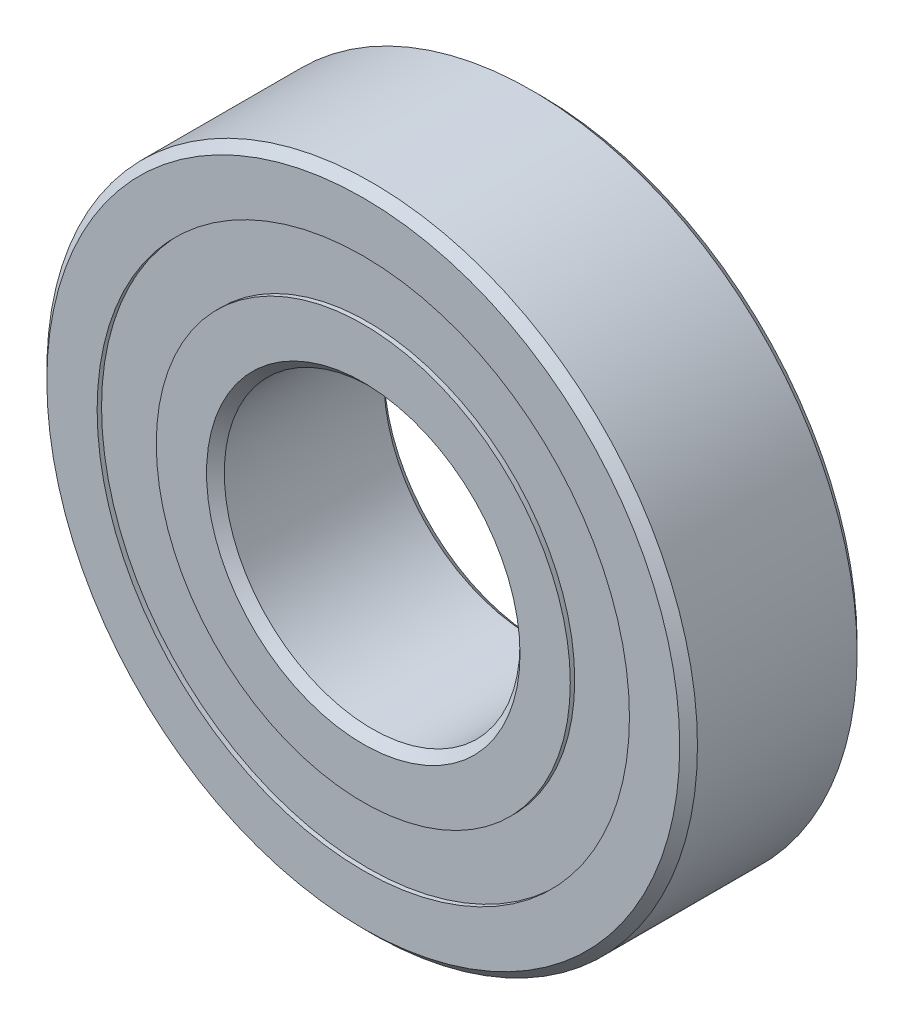
ISO-10303-21;
HEADER;
FILE_DESCRIPTION(('STEP AP214'),'2;1');
FILE_NAME('part.step','',(''),(''),'','','');
FILE_SCHEMA(('AUTOMOTIVE_DESIGN { 1 0 10303 214 1 1 1 1 }'));
ENDSEC;
DATA;
#1=APPLICATION_CONTEXT('core data for automotive mechanical design processes');
#2=APPLICATION_PROTOCOL_DEFINITION('international standard','automotive_design',2000,#1);
#3=PRODUCT_CONTEXT('',#1,'mechanical');
#4=PRODUCT('Part','Part','',(#3));
#5=PRODUCT_RELATED_PRODUCT_CATEGORY('part','',(#4));
#6=PRODUCT_DEFINITION_FORMATION('','',#4);
#7=PRODUCT_DEFINITION_CONTEXT('part definition',#1,'design');
#8=PRODUCT_DEFINITION('design','',#6,#7);
#9=PRODUCT_DEFINITION_SHAPE('','',#8);
#10=(LENGTH_UNIT() NAMED_UNIT(*) SI_UNIT(.MILLI.,.METRE.));
#11=(NAMED_UNIT(*) PLANE_ANGLE_UNIT() SI_UNIT($,.RADIAN.));
#12=(NAMED_UNIT(*) SI_UNIT($,.STERADIAN.) SOLID_ANGLE_UNIT());
#13=UNCERTAINTY_MEASURE_WITH_UNIT(LENGTH_MEASURE(1.E-05),#10,'distance_accuracy_value','');
#14=(GEOMETRIC_REPRESENTATION_CONTEXT(3) GLOBAL_UNCERTAINTY_ASSIGNED_CONTEXT((#13)) GLOBAL_UNIT_ASSIGNED_CONTEXT((#10,
#11,#12)) REPRESENTATION_CONTEXT('',''));
#15=CARTESIAN_POINT('',(0.,0.,0.));
#16=DIRECTION('',(0.,0.,1.));
#17=DIRECTION('',(1.,0.,0.));
#18=AXIS2_PLACEMENT_3D('',#15,#16,#17);
#19=CARTESIAN_POINT('',(0.,9.,-2.85));
#20=DIRECTION('',(0.,0.,1.));
#21=DIRECTION('',(1.,0.,0.));
#22=AXIS2_PLACEMENT_3D('',#19,#20,#21);
#23=PLANE('',#22);
#24=CARTESIAN_POINT('',(0.,0.,-2.85));
#25=DIRECTION('',(0.,0.,1.));
#26=DIRECTION('',(1.,0.,0.));
#27=AXIS2_PLACEMENT_3D('',#24,#25,#26);
#28=CIRCLE('',#27,9.);
#29=CARTESIAN_POINT('',(9.,0.,-2.85));
#30=VERTEX_POINT('',#29);
#31=EDGE_CURVE('E57',#30,#30,#28,.T.);
#32=ORIENTED_EDGE('',*,*,#31,.F.);
#33=EDGE_LOOP('',(#32));
#34=FACE_BOUND('',#33,.T.);
#35=CARTESIAN_POINT('',(0.,0.,-2.85));
#36=DIRECTION('',(0.,0.,1.));
#37=DIRECTION('',(1.,0.,0.));
#38=AXIS2_PLACEMENT_3D('',#35,#36,#37);
#39=CIRCLE('',#38,7.);
#40=CARTESIAN_POINT('',(7.,0.,-2.85));
#41=VERTEX_POINT('',#40);
#42=EDGE_CURVE('E11',#41,#41,#39,.T.);
#43=ORIENTED_EDGE('',*,*,#42,.T.);
#44=EDGE_LOOP('',(#43));
#45=FACE_BOUND('',#44,.T.);
#46=ADVANCED_FACE('F43',(#34,#45),#23,.F.);
#47=CARTESIAN_POINT('',(0.,0.,3.));
#48=DIRECTION('',(0.,0.,1.));
#49=DIRECTION('',(1.,0.,0.));
#50=AXIS2_PLACEMENT_3D('',#47,#48,#49);
#51=CYLINDRICAL_SURFACE('',#50,7.);
#52=ORIENTED_EDGE('',*,*,#42,.F.);
#53=EDGE_LOOP('',(#52));
#54=FACE_BOUND('',#53,.T.);
#55=CARTESIAN_POINT('',(0.,0.,-1.66666666666667));
#56=DIRECTION('',(0.,0.,1.));
#57=DIRECTION('',(1.,0.,0.));
#58=AXIS2_PLACEMENT_3D('',#55,#56,#57);
#59=CIRCLE('',#58,7.);
#60=CARTESIAN_POINT('',(7.,0.,-1.66666666666667));
#61=VERTEX_POINT('',#60);
#62=EDGE_CURVE('E49',#61,#61,#59,.T.);
#63=ORIENTED_EDGE('',*,*,#62,.T.);
#64=EDGE_LOOP('',(#63));
#65=FACE_BOUND('',#64,.T.);
#66=ADVANCED_FACE('F66',(#54,#65),#51,.F.);
#67=CARTESIAN_POINT('',(0.,9.,-1.66666666666667));
#68=DIRECTION('',(0.,0.,-1.));
#69=DIRECTION('',(-1.,0.,0.));
#70=AXIS2_PLACEMENT_3D('',#67,#68,#69);
#71=PLANE('',#70);
#72=ORIENTED_EDGE('',*,*,#62,.F.);
#73=EDGE_LOOP('',(#72));
#74=FACE_BOUND('',#73,.T.);
#75=CARTESIAN_POINT('',(0.,0.,-1.66666666666667));
#76=DIRECTION('',(0.,0.,1.));
#77=DIRECTION('',(1.,0.,0.));
#78=AXIS2_PLACEMENT_3D('',#75,#76,#77);
#79=CIRCLE('',#78,9.);
#80=CARTESIAN_POINT('',(9.,0.,-1.66666666666667));
#81=VERTEX_POINT('',#80);
#82=EDGE_CURVE('E53',#81,#81,#79,.T.);
#83=ORIENTED_EDGE('',*,*,#82,.T.);
#84=EDGE_LOOP('',(#83));
#85=FACE_BOUND('',#84,.T.);
#86=ADVANCED_FACE('F70',(#74,#85),#71,.F.);
#87=CARTESIAN_POINT('',(0.,0.,3.));
#88=DIRECTION('',(0.,0.,1.));
#89=DIRECTION('',(1.,0.,0.));
#90=AXIS2_PLACEMENT_3D('',#87,#88,#89);
#91=CYLINDRICAL_SURFACE('',#90,9.);
#92=ORIENTED_EDGE('',*,*,#82,.F.);
#93=EDGE_LOOP('',(#92));
#94=FACE_BOUND('',#93,.T.);
#95=ORIENTED_EDGE('',*,*,#31,.T.);
#96=EDGE_LOOP('',(#95));
#97=FACE_BOUND('',#96,.T.);
#98=ADVANCED_FACE('F63',(#94,#97),#91,.T.);
#99=CLOSED_SHELL('',(#46,#66,#86,#98));
#100=MANIFOLD_SOLID_BREP('B2',#99);
#101=CARTESIAN_POINT('',(0.,9.,2.85));
#102=DIRECTION('',(0.,0.,-1.));
#103=DIRECTION('',(-1.,0.,0.));
#104=AXIS2_PLACEMENT_3D('',#101,#102,#103);
#105=PLANE('',#104);
#106=CARTESIAN_POINT('',(0.,0.,2.85));
#107=DIRECTION('',(0.,0.,1.));
#108=DIRECTION('',(1.,0.,0.));
#109=AXIS2_PLACEMENT_3D('',#106,#107,#108);
#110=CIRCLE('',#109,7.);
#111=CARTESIAN_POINT('',(7.,0.,2.85));
#112=VERTEX_POINT('',#111);
#113=EDGE_CURVE('E42',#112,#112,#110,.T.);
#114=ORIENTED_EDGE('',*,*,#113,.F.);
#115=EDGE_LOOP('',(#114));
#116=FACE_BOUND('',#115,.T.);
#117=CARTESIAN_POINT('',(0.,0.,2.85));
#118=DIRECTION('',(0.,0.,1.));
#119=DIRECTION('',(1.,0.,0.));
#120=AXIS2_PLACEMENT_3D('',#117,#118,#119);
#121=CIRCLE('',#120,9.);
#122=CARTESIAN_POINT('',(9.,0.,2.85));
#123=VERTEX_POINT('',#122);
#124=EDGE_CURVE('E124',#123,#123,#121,.T.);
#125=ORIENTED_EDGE('',*,*,#124,.T.);
#126=EDGE_LOOP('',(#125));
#127=FACE_BOUND('',#126,.T.);
#128=ADVANCED_FACE('F110',(#116,#127),#105,.F.);
#129=CARTESIAN_POINT('',(0.,0.,3.));
#130=DIRECTION('',(0.,0.,1.));
#131=DIRECTION('',(1.,0.,0.));
#132=AXIS2_PLACEMENT_3D('',#129,#130,#131);
#133=CYLINDRICAL_SURFACE('',#132,7.);
#134=CARTESIAN_POINT('',(0.,0.,1.66666666666667));
#135=DIRECTION('',(0.,0.,1.));
#136=DIRECTION('',(1.,0.,0.));
#137=AXIS2_PLACEMENT_3D('',#134,#135,#136);
#138=CIRCLE('',#137,7.);
#139=CARTESIAN_POINT('',(7.,0.,1.66666666666667));
#140=VERTEX_POINT('',#139);
#141=EDGE_CURVE('E116',#140,#140,#138,.T.);
#142=ORIENTED_EDGE('',*,*,#141,.F.);
#143=EDGE_LOOP('',(#142));
#144=FACE_BOUND('',#143,.T.);
#145=ORIENTED_EDGE('',*,*,#113,.T.);
#146=EDGE_LOOP('',(#145));
#147=FACE_BOUND('',#146,.T.);
#148=ADVANCED_FACE('F139',(#144,#147),#133,.F.);
#149=CARTESIAN_POINT('',(0.,9.,1.66666666666667));
#150=DIRECTION('',(0.,0.,1.));
#151=DIRECTION('',(1.,0.,0.));
#152=AXIS2_PLACEMENT_3D('',#149,#150,#151);
#153=PLANE('',#152);
#154=CARTESIAN_POINT('',(0.,0.,1.66666666666667));
#155=DIRECTION('',(0.,0.,1.));
#156=DIRECTION('',(1.,0.,0.));
#157=AXIS2_PLACEMENT_3D('',#154,#155,#156);
#158=CIRCLE('',#157,9.);
#159=CARTESIAN_POINT('',(9.,0.,1.66666666666667));
#160=VERTEX_POINT('',#159);
#161=EDGE_CURVE('E120',#160,#160,#158,.T.);
#162=ORIENTED_EDGE('',*,*,#161,.F.);
#163=EDGE_LOOP('',(#162));
#164=FACE_BOUND('',#163,.T.);
#165=ORIENTED_EDGE('',*,*,#141,.T.);
#166=EDGE_LOOP('',(#165));
#167=FACE_BOUND('',#166,.T.);
#168=ADVANCED_FACE('F134',(#164,#167),#153,.F.);
#169=CARTESIAN_POINT('',(0.,0.,3.));
#170=DIRECTION('',(0.,0.,1.));
#171=DIRECTION('',(1.,0.,0.));
#172=AXIS2_PLACEMENT_3D('',#169,#170,#171);
#173=CYLINDRICAL_SURFACE('',#172,9.);
#174=ORIENTED_EDGE('',*,*,#124,.F.);
#175=EDGE_LOOP('',(#174));
#176=FACE_BOUND('',#175,.T.);
#177=ORIENTED_EDGE('',*,*,#161,.T.);
#178=EDGE_LOOP('',(#177));
#179=FACE_BOUND('',#178,.T.);
#180=ADVANCED_FACE('F131',(#176,#179),#173,.T.);
#181=CLOSED_SHELL('',(#128,#148,#168,#180));
#182=MANIFOLD_SOLID_BREP('B6',#181);
#183=CARTESIAN_POINT('',(-4.7022820183397,6.47213595499964,0.));
#184=DIRECTION('',(0.,0.,1.));
#185=DIRECTION('',(-0.587785252292462,0.809016994374955,0.));
#186=AXIS2_PLACEMENT_3D('',#183,#184,#185);
#187=SPHERICAL_SURFACE('',#186,1.66666666666667);
#188=CARTESIAN_POINT('',(-4.7022820183397,6.47213595499964,1.66666666666667));
#189=VERTEX_POINT('',#188);
#190=VERTEX_LOOP('',#189);
#191=FACE_BOUND('',#190,.T.);
#192=ADVANCED_FACE('F177',(#191),#187,.T.);
#193=CLOSED_SHELL('',(#192));
#194=MANIFOLD_SOLID_BREP('B37',#193);
#195=CARTESIAN_POINT('',(-7.6084521303612,2.47213595499967,0.));
#196=DIRECTION('',(0.,0.,1.));
#197=DIRECTION('',(-0.95105651629515,0.309016994374958,0.));
#198=AXIS2_PLACEMENT_3D('',#195,#196,#197);
#199=SPHERICAL_SURFACE('',#198,1.66666666666667);
#200=CARTESIAN_POINT('',(-7.6084521303612,2.47213595499967,1.66666666666667));
#201=VERTEX_POINT('',#200);
#202=VERTEX_LOOP('',#201);
#203=FACE_BOUND('',#202,.T.);
#204=ADVANCED_FACE('F197',(#203),#199,.T.);
#205=CLOSED_SHELL('',(#204));
#206=MANIFOLD_SOLID_BREP('B106',#205);
#207=CARTESIAN_POINT('',(-7.60845213036125,-2.47213595499951,0.));
#208=DIRECTION('',(0.,0.,1.));
#209=DIRECTION('',(-0.951056516295157,-0.309016994374938,0.));
#210=AXIS2_PLACEMENT_3D('',#207,#208,#209);
#211=SPHERICAL_SURFACE('',#210,1.66666666666667);
#212=CARTESIAN_POINT('',(-7.60845213036125,-2.47213595499951,1.66666666666667));
#213=VERTEX_POINT('',#212);
#214=VERTEX_LOOP('',#213);
#215=FACE_BOUND('',#214,.T.);
#216=ADVANCED_FACE('F217',(#215),#211,.T.);
#217=CLOSED_SHELL('',(#216));
#218=MANIFOLD_SOLID_BREP('B173',#217);
#219=CARTESIAN_POINT('',(-4.70228201833984,-6.47213595499954,0.));
#220=DIRECTION('',(0.,0.,1.));
#221=DIRECTION('',(-0.58778525229248,-0.809016994374942,0.));
#222=AXIS2_PLACEMENT_3D('',#219,#220,#221);
#223=SPHERICAL_SURFACE('',#222,1.66666666666667);
#224=CARTESIAN_POINT('',(-4.70228201833984,-6.47213595499954,1.66666666666667));
#225=VERTEX_POINT('',#224);
#226=VERTEX_LOOP('',#225);
#227=FACE_BOUND('',#226,.T.);
#228=ADVANCED_FACE('F237',(#227),#223,.T.);
#229=CLOSED_SHELL('',(#228));
#230=MANIFOLD_SOLID_BREP('B193',#229);
#231=CARTESIAN_POINT('',(0.,-8.,0.));
#232=DIRECTION('',(0.,0.,1.));
#233=DIRECTION('',(0.,-1.,0.));
#234=AXIS2_PLACEMENT_3D('',#231,#232,#233);
#235=SPHERICAL_SURFACE('',#234,1.66666666666667);
#236=CARTESIAN_POINT('',(0.,-8.,1.66666666666667));
#237=VERTEX_POINT('',#236);
#238=VERTEX_LOOP('',#237);
#239=FACE_BOUND('',#238,.T.);
#240=ADVANCED_FACE('F257',(#239),#235,.T.);
#241=CLOSED_SHELL('',(#240));
#242=MANIFOLD_SOLID_BREP('B213',#241);
#243=CARTESIAN_POINT('',(4.70228201833975,-6.47213595499961,0.));
#244=DIRECTION('',(0.,0.,1.));
#245=DIRECTION('',(0.587785252292469,-0.809016994374951,0.));
#246=AXIS2_PLACEMENT_3D('',#243,#244,#245);
#247=SPHERICAL_SURFACE('',#246,1.66666666666667);
#248=CARTESIAN_POINT('',(4.70228201833975,-6.47213595499961,1.66666666666667));
#249=VERTEX_POINT('',#248);
#250=VERTEX_LOOP('',#249);
#251=FACE_BOUND('',#250,.T.);
#252=ADVANCED_FACE('F277',(#251),#247,.T.);
#253=CLOSED_SHELL('',(#252));
#254=MANIFOLD_SOLID_BREP('B233',#253);
#255=CARTESIAN_POINT('',(7.60845213036122,-2.47213595499961,0.));
#256=DIRECTION('',(0.,0.,1.));
#257=DIRECTION('',(0.951056516295152,-0.309016994374952,0.));
#258=AXIS2_PLACEMENT_3D('',#255,#256,#257);
#259=SPHERICAL_SURFACE('',#258,1.66666666666667);
#260=CARTESIAN_POINT('',(7.60845213036122,-2.47213595499961,1.66666666666667));
#261=VERTEX_POINT('',#260);
#262=VERTEX_LOOP('',#261);
#263=FACE_BOUND('',#262,.T.);
#264=ADVANCED_FACE('F297',(#263),#259,.T.);
#265=CLOSED_SHELL('',(#264));
#266=MANIFOLD_SOLID_BREP('B253',#265);
#267=CARTESIAN_POINT('',(7.60845213036124,2.47213595499956,0.));
#268=DIRECTION('',(0.,0.,1.));
#269=DIRECTION('',(0.951056516295155,0.309016994374945,0.));
#270=AXIS2_PLACEMENT_3D('',#267,#268,#269);
#271=SPHERICAL_SURFACE('',#270,1.66666666666667);
#272=CARTESIAN_POINT('',(7.60845213036124,2.47213595499956,1.66666666666667));
#273=VERTEX_POINT('',#272);
#274=VERTEX_LOOP('',#273);
#275=FACE_BOUND('',#274,.T.);
#276=ADVANCED_FACE('F317',(#275),#271,.T.);
#277=CLOSED_SHELL('',(#276));
#278=MANIFOLD_SOLID_BREP('B273',#277);
#279=CARTESIAN_POINT('',(4.70228201833979,6.47213595499957,0.));
#280=DIRECTION('',(0.,0.,1.));
#281=DIRECTION('',(0.587785252292474,0.809016994374947,0.));
#282=AXIS2_PLACEMENT_3D('',#279,#280,#281);
#283=SPHERICAL_SURFACE('',#282,1.66666666666667);
#284=CARTESIAN_POINT('',(4.70228201833979,6.47213595499957,1.66666666666667));
#285=VERTEX_POINT('',#284);
#286=VERTEX_LOOP('',#285);
#287=FACE_BOUND('',#286,.T.);
#288=ADVANCED_FACE('F337',(#287),#283,.T.);
#289=CLOSED_SHELL('',(#288));
#290=MANIFOLD_SOLID_BREP('B293',#289);
#291=CARTESIAN_POINT('',(0.,8.,0.));
#292=DIRECTION('',(0.,0.,1.));
#293=DIRECTION('',(0.,1.,0.));
#294=AXIS2_PLACEMENT_3D('',#291,#292,#293);
#295=SPHERICAL_SURFACE('',#294,1.66666666666667);
#296=CARTESIAN_POINT('',(0.,8.,1.66666666666667));
#297=VERTEX_POINT('',#296);
#298=VERTEX_LOOP('',#297);
#299=FACE_BOUND('',#298,.T.);
#300=ADVANCED_FACE('F359',(#299),#295,.T.);
#301=CLOSED_SHELL('',(#300));
#302=MANIFOLD_SOLID_BREP('B313',#301);
#303=CARTESIAN_POINT('',(0.,0.,3.));
#304=DIRECTION('',(0.,0.,1.));
#305=DIRECTION('',(1.,0.,0.));
#306=AXIS2_PLACEMENT_3D('',#303,#304,#305);
#307=CONICAL_SURFACE('',#306,5.3,0.78539816339745);
#308=CARTESIAN_POINT('',(0.,0.,2.7));
#309=DIRECTION('',(0.,0.,1.));
#310=DIRECTION('',(1.,0.,0.));
#311=AXIS2_PLACEMENT_3D('',#308,#309,#310);
#312=CIRCLE('',#311,5.);
#313=CARTESIAN_POINT('',(5.,0.,2.7));
#314=VERTEX_POINT('',#313);
#315=EDGE_CURVE('E358',#314,#314,#312,.T.);
#316=ORIENTED_EDGE('',*,*,#315,.F.);
#317=EDGE_LOOP('',(#316));
#318=FACE_BOUND('',#317,.T.);
#319=CARTESIAN_POINT('',(0.,0.,3.));
#320=DIRECTION('',(0.,0.,1.));
#321=DIRECTION('',(1.,0.,0.));
#322=AXIS2_PLACEMENT_3D('',#319,#320,#321);
#323=CIRCLE('',#322,5.3);
#324=CARTESIAN_POINT('',(5.3,0.,3.));
#325=VERTEX_POINT('',#324);
#326=EDGE_CURVE('E406',#325,#325,#323,.T.);
#327=ORIENTED_EDGE('',*,*,#326,.T.);
#328=EDGE_LOOP('',(#327));
#329=FACE_BOUND('',#328,.T.);
#330=ADVANCED_FACE('F378',(#318,#329),#307,.F.);
#331=CARTESIAN_POINT('',(0.,0.,3.));
#332=DIRECTION('',(0.,0.,1.));
#333=DIRECTION('',(1.,0.,0.));
#334=AXIS2_PLACEMENT_3D('',#331,#332,#333);
#335=CYLINDRICAL_SURFACE('',#334,5.);
#336=CARTESIAN_POINT('',(0.,0.,-2.7));
#337=DIRECTION('',(0.,0.,1.));
#338=DIRECTION('',(1.,0.,0.));
#339=AXIS2_PLACEMENT_3D('',#336,#337,#338);
#340=CIRCLE('',#339,5.);
#341=CARTESIAN_POINT('',(5.,0.,-2.7));
#342=VERTEX_POINT('',#341);
#343=EDGE_CURVE('E384',#342,#342,#340,.T.);
#344=ORIENTED_EDGE('',*,*,#343,.F.);
#345=EDGE_LOOP('',(#344));
#346=FACE_BOUND('',#345,.T.);
#347=ORIENTED_EDGE('',*,*,#315,.T.);
#348=EDGE_LOOP('',(#347));
#349=FACE_BOUND('',#348,.T.);
#350=ADVANCED_FACE('F443',(#346,#349),#335,.F.);
#351=CARTESIAN_POINT('',(0.,0.,-2.7));
#352=DIRECTION('',(0.,0.,-1.));
#353=DIRECTION('',(-1.,0.,0.));
#354=AXIS2_PLACEMENT_3D('',#351,#352,#353);
#355=CONICAL_SURFACE('',#354,5.,0.78539816339745);
#356=CARTESIAN_POINT('',(0.,0.,-3.));
#357=DIRECTION('',(0.,0.,1.));
#358=DIRECTION('',(1.,0.,0.));
#359=AXIS2_PLACEMENT_3D('',#356,#357,#358);
#360=CIRCLE('',#359,5.3);
#361=CARTESIAN_POINT('',(5.3,0.,-3.));
#362=VERTEX_POINT('',#361);
#363=EDGE_CURVE('E388',#362,#362,#360,.T.);
#364=ORIENTED_EDGE('',*,*,#363,.F.);
#365=EDGE_LOOP('',(#364));
#366=FACE_BOUND('',#365,.T.);
#367=ORIENTED_EDGE('',*,*,#343,.T.);
#368=EDGE_LOOP('',(#367));
#369=FACE_BOUND('',#368,.T.);
#370=ADVANCED_FACE('F438',(#366,#369),#355,.F.);
#371=CARTESIAN_POINT('',(0.,5.3,-3.));
#372=DIRECTION('',(0.,0.,1.));
#373=DIRECTION('',(1.,0.,0.));
#374=AXIS2_PLACEMENT_3D('',#371,#372,#373);
#375=PLANE('',#374);
#376=CARTESIAN_POINT('',(0.,0.,-3.));
#377=DIRECTION('',(0.,0.,1.));
#378=DIRECTION('',(1.,0.,0.));
#379=AXIS2_PLACEMENT_3D('',#376,#377,#378);
#380=CIRCLE('',#379,7.);
#381=CARTESIAN_POINT('',(7.,0.,-3.));
#382=VERTEX_POINT('',#381);
#383=EDGE_CURVE('E392',#382,#382,#380,.T.);
#384=ORIENTED_EDGE('',*,*,#383,.F.);
#385=EDGE_LOOP('',(#384));
#386=FACE_BOUND('',#385,.T.);
#387=ORIENTED_EDGE('',*,*,#363,.T.);
#388=EDGE_LOOP('',(#387));
#389=FACE_BOUND('',#388,.T.);
#390=ADVANCED_FACE('F432',(#386,#389),#375,.F.);
#391=CARTESIAN_POINT('',(0.,0.,3.));
#392=DIRECTION('',(0.,0.,1.));
#393=DIRECTION('',(1.,0.,0.));
#394=AXIS2_PLACEMENT_3D('',#391,#392,#393);
#395=CYLINDRICAL_SURFACE('',#394,7.);
#396=CARTESIAN_POINT('',(0.,0.,-1.33333333333333));
#397=DIRECTION('',(0.,0.,1.));
#398=DIRECTION('',(1.,0.,0.));
#399=AXIS2_PLACEMENT_3D('',#396,#397,#398);
#400=CIRCLE('',#399,7.);
#401=CARTESIAN_POINT('',(7.,0.,-1.33333333333333));
#402=VERTEX_POINT('',#401);
#403=EDGE_CURVE('E397',#402,#402,#400,.T.);
#404=ORIENTED_EDGE('',*,*,#403,.F.);
#405=EDGE_LOOP('',(#404));
#406=FACE_BOUND('',#405,.T.);
#407=ORIENTED_EDGE('',*,*,#383,.T.);
#408=EDGE_LOOP('',(#407));
#409=FACE_BOUND('',#408,.T.);
#410=ADVANCED_FACE('F426',(#406,#409),#395,.T.);
#411=CARTESIAN_POINT('',(0.,0.,0.));
#412=DIRECTION('',(0.,0.,1.));
#413=DIRECTION('',(1.,0.,0.));
#414=AXIS2_PLACEMENT_3D('',#411,#412,#413);
#415=TOROIDAL_SURFACE('',#414,8.,1.66666666666667);
#416=CARTESIAN_POINT('',(0.,0.,1.33333333333333));
#417=DIRECTION('',(0.,0.,1.));
#418=DIRECTION('',(1.,0.,0.));
#419=AXIS2_PLACEMENT_3D('',#416,#417,#418);
#420=CIRCLE('',#419,7.);
#421=CARTESIAN_POINT('',(7.,0.,1.33333333333333));
#422=VERTEX_POINT('',#421);
#423=EDGE_CURVE('E400',#422,#422,#420,.T.);
#424=ORIENTED_EDGE('',*,*,#423,.F.);
#425=EDGE_LOOP('',(#424));
#426=FACE_BOUND('',#425,.T.);
#427=ORIENTED_EDGE('',*,*,#403,.T.);
#428=EDGE_LOOP('',(#427));
#429=FACE_BOUND('',#428,.T.);
#430=ADVANCED_FACE('F420',(#426,#429),#415,.F.);
#431=CARTESIAN_POINT('',(0.,0.,3.));
#432=DIRECTION('',(0.,0.,1.));
#433=DIRECTION('',(1.,0.,0.));
#434=AXIS2_PLACEMENT_3D('',#431,#432,#433);
#435=CYLINDRICAL_SURFACE('',#434,7.);
#436=CARTESIAN_POINT('',(0.,0.,3.));
#437=DIRECTION('',(0.,0.,1.));
#438=DIRECTION('',(1.,0.,0.));
#439=AXIS2_PLACEMENT_3D('',#436,#437,#438);
#440=CIRCLE('',#439,7.);
#441=CARTESIAN_POINT('',(7.,0.,3.));
#442=VERTEX_POINT('',#441);
#443=EDGE_CURVE('E403',#442,#442,#440,.T.);
#444=ORIENTED_EDGE('',*,*,#443,.F.);
#445=EDGE_LOOP('',(#444));
#446=FACE_BOUND('',#445,.T.);
#447=ORIENTED_EDGE('',*,*,#423,.T.);
#448=EDGE_LOOP('',(#447));
#449=FACE_BOUND('',#448,.T.);
#450=ADVANCED_FACE('F414',(#446,#449),#435,.T.);
#451=CARTESIAN_POINT('',(0.,5.3,3.));
#452=DIRECTION('',(0.,0.,-1.));
#453=DIRECTION('',(-1.,0.,0.));
#454=AXIS2_PLACEMENT_3D('',#451,#452,#453);
#455=PLANE('',#454);
#456=ORIENTED_EDGE('',*,*,#326,.F.);
#457=EDGE_LOOP('',(#456));
#458=FACE_BOUND('',#457,.T.);
#459=ORIENTED_EDGE('',*,*,#443,.T.);
#460=EDGE_LOOP('',(#459));
#461=FACE_BOUND('',#460,.T.);
#462=ADVANCED_FACE('F411',(#458,#461),#455,.F.);
#463=CLOSED_SHELL('',(#330,#350,#370,#390,#410,#430,#450,#462));
#464=MANIFOLD_SOLID_BREP('B333',#463);
#465=CARTESIAN_POINT('',(0.,0.,2.7));
#466=DIRECTION('',(0.,0.,-1.));
#467=DIRECTION('',(-1.,0.,0.));
#468=AXIS2_PLACEMENT_3D('',#465,#466,#467);
#469=CONICAL_SURFACE('',#468,11.,0.785398163397451);
#470=CARTESIAN_POINT('',(0.,0.,3.));
#471=DIRECTION('',(0.,0.,1.));
#472=DIRECTION('',(1.,0.,0.));
#473=AXIS2_PLACEMENT_3D('',#470,#471,#472);
#474=CIRCLE('',#473,10.7);
#475=CARTESIAN_POINT('',(10.7,0.,3.));
#476=VERTEX_POINT('',#475);
#477=EDGE_CURVE('E377',#476,#476,#474,.T.);
#478=ORIENTED_EDGE('',*,*,#477,.F.);
#479=EDGE_LOOP('',(#478));
#480=FACE_BOUND('',#479,.T.);
#481=CARTESIAN_POINT('',(0.,0.,2.7));
#482=DIRECTION('',(0.,0.,1.));
#483=DIRECTION('',(1.,0.,0.));
#484=AXIS2_PLACEMENT_3D('',#481,#482,#483);
#485=CIRCLE('',#484,11.);
#486=CARTESIAN_POINT('',(11.,0.,2.7));
#487=VERTEX_POINT('',#486);
#488=EDGE_CURVE('E527',#487,#487,#485,.T.);
#489=ORIENTED_EDGE('',*,*,#488,.T.);
#490=EDGE_LOOP('',(#489));
#491=FACE_BOUND('',#490,.T.);
#492=ADVANCED_FACE('F499',(#480,#491),#469,.T.);
#493=CARTESIAN_POINT('',(0.,10.7,3.));
#494=DIRECTION('',(0.,0.,-1.));
#495=DIRECTION('',(-1.,0.,0.));
#496=AXIS2_PLACEMENT_3D('',#493,#494,#495);
#497=PLANE('',#496);
#498=CARTESIAN_POINT('',(0.,0.,3.));
#499=DIRECTION('',(0.,0.,1.));
#500=DIRECTION('',(1.,0.,0.));
#501=AXIS2_PLACEMENT_3D('',#498,#499,#500);
#502=CIRCLE('',#501,9.);
#503=CARTESIAN_POINT('',(9.,0.,3.));
#504=VERTEX_POINT('',#503);
#505=EDGE_CURVE('E505',#504,#504,#502,.T.);
#506=ORIENTED_EDGE('',*,*,#505,.F.);
#507=EDGE_LOOP('',(#506));
#508=FACE_BOUND('',#507,.T.);
#509=ORIENTED_EDGE('',*,*,#477,.T.);
#510=EDGE_LOOP('',(#509));
#511=FACE_BOUND('',#510,.T.);
#512=ADVANCED_FACE('F564',(#508,#511),#497,.F.);
#513=CARTESIAN_POINT('',(0.,0.,3.));
#514=DIRECTION('',(0.,0.,1.));
#515=DIRECTION('',(1.,0.,0.));
#516=AXIS2_PLACEMENT_3D('',#513,#514,#515);
#517=CYLINDRICAL_SURFACE('',#516,9.);
#518=CARTESIAN_POINT('',(0.,0.,1.33333333333333));
#519=DIRECTION('',(0.,0.,1.));
#520=DIRECTION('',(1.,0.,0.));
#521=AXIS2_PLACEMENT_3D('',#518,#519,#520);
#522=CIRCLE('',#521,9.);
#523=CARTESIAN_POINT('',(9.,0.,1.33333333333333));
#524=VERTEX_POINT('',#523);
#525=EDGE_CURVE('E509',#524,#524,#522,.T.);
#526=ORIENTED_EDGE('',*,*,#525,.F.);
#527=EDGE_LOOP('',(#526));
#528=FACE_BOUND('',#527,.T.);
#529=ORIENTED_EDGE('',*,*,#505,.T.);
#530=EDGE_LOOP('',(#529));
#531=FACE_BOUND('',#530,.T.);
#532=ADVANCED_FACE('F559',(#528,#531),#517,.F.);
#533=CARTESIAN_POINT('',(0.,0.,0.));
#534=DIRECTION('',(0.,0.,1.));
#535=DIRECTION('',(1.,0.,0.));
#536=AXIS2_PLACEMENT_3D('',#533,#534,#535);
#537=TOROIDAL_SURFACE('',#536,8.,1.66666666666667);
#538=CARTESIAN_POINT('',(0.,0.,-1.33333333333333));
#539=DIRECTION('',(0.,0.,1.));
#540=DIRECTION('',(1.,0.,0.));
#541=AXIS2_PLACEMENT_3D('',#538,#539,#540);
#542=CIRCLE('',#541,9.);
#543=CARTESIAN_POINT('',(9.,0.,-1.33333333333333));
#544=VERTEX_POINT('',#543);
#545=EDGE_CURVE('E513',#544,#544,#542,.T.);
#546=ORIENTED_EDGE('',*,*,#545,.F.);
#547=EDGE_LOOP('',(#546));
#548=FACE_BOUND('',#547,.T.);
#549=ORIENTED_EDGE('',*,*,#525,.T.);
#550=EDGE_LOOP('',(#549));
#551=FACE_BOUND('',#550,.T.);
#552=ADVANCED_FACE('F553',(#548,#551),#537,.F.);
#553=CARTESIAN_POINT('',(0.,0.,3.));
#554=DIRECTION('',(0.,0.,1.));
#555=DIRECTION('',(1.,0.,0.));
#556=AXIS2_PLACEMENT_3D('',#553,#554,#555);
#557=CYLINDRICAL_SURFACE('',#556,9.);
#558=CARTESIAN_POINT('',(0.,0.,-3.));
#559=DIRECTION('',(0.,0.,1.));
#560=DIRECTION('',(1.,0.,0.));
#561=AXIS2_PLACEMENT_3D('',#558,#559,#560);
#562=CIRCLE('',#561,9.);
#563=CARTESIAN_POINT('',(9.,0.,-3.));
#564=VERTEX_POINT('',#563);
#565=EDGE_CURVE('E518',#564,#564,#562,.T.);
#566=ORIENTED_EDGE('',*,*,#565,.F.);
#567=EDGE_LOOP('',(#566));
#568=FACE_BOUND('',#567,.T.);
#569=ORIENTED_EDGE('',*,*,#545,.T.);
#570=EDGE_LOOP('',(#569));
#571=FACE_BOUND('',#570,.T.);
#572=ADVANCED_FACE('F547',(#568,#571),#557,.F.);
#573=CARTESIAN_POINT('',(0.,10.7,-3.));
#574=DIRECTION('',(0.,0.,1.));
#575=DIRECTION('',(1.,0.,0.));
#576=AXIS2_PLACEMENT_3D('',#573,#574,#575);
#577=PLANE('',#576);
#578=CARTESIAN_POINT('',(0.,0.,-3.));
#579=DIRECTION('',(0.,0.,1.));
#580=DIRECTION('',(1.,0.,0.));
#581=AXIS2_PLACEMENT_3D('',#578,#579,#580);
#582=CIRCLE('',#581,10.7);
#583=CARTESIAN_POINT('',(10.7,0.,-3.));
#584=VERTEX_POINT('',#583);
#585=EDGE_CURVE('E521',#584,#584,#582,.T.);
#586=ORIENTED_EDGE('',*,*,#585,.F.);
#587=EDGE_LOOP('',(#586));
#588=FACE_BOUND('',#587,.T.);
#589=ORIENTED_EDGE('',*,*,#565,.T.);
#590=EDGE_LOOP('',(#589));
#591=FACE_BOUND('',#590,.T.);
#592=ADVANCED_FACE('F541',(#588,#591),#577,.F.);
#593=CARTESIAN_POINT('',(0.,0.,-3.));
#594=DIRECTION('',(0.,0.,1.));
#595=DIRECTION('',(1.,0.,0.));
#596=AXIS2_PLACEMENT_3D('',#593,#594,#595);
#597=CONICAL_SURFACE('',#596,10.7,0.785398163397448);
#598=CARTESIAN_POINT('',(0.,0.,-2.7));
#599=DIRECTION('',(0.,0.,1.));
#600=DIRECTION('',(1.,0.,0.));
#601=AXIS2_PLACEMENT_3D('',#598,#599,#600);
#602=CIRCLE('',#601,11.);
#603=CARTESIAN_POINT('',(11.,0.,-2.7));
#604=VERTEX_POINT('',#603);
#605=EDGE_CURVE('E524',#604,#604,#602,.T.);
#606=ORIENTED_EDGE('',*,*,#605,.F.);
#607=EDGE_LOOP('',(#606));
#608=FACE_BOUND('',#607,.T.);
#609=ORIENTED_EDGE('',*,*,#585,.T.);
#610=EDGE_LOOP('',(#609));
#611=FACE_BOUND('',#610,.T.);
#612=ADVANCED_FACE('F535',(#608,#611),#597,.T.);
#613=CARTESIAN_POINT('',(0.,0.,3.));
#614=DIRECTION('',(0.,0.,1.));
#615=DIRECTION('',(1.,0.,0.));
#616=AXIS2_PLACEMENT_3D('',#613,#614,#615);
#617=CYLINDRICAL_SURFACE('',#616,11.);
#618=ORIENTED_EDGE('',*,*,#488,.F.);
#619=EDGE_LOOP('',(#618));
#620=FACE_BOUND('',#619,.T.);
#621=ORIENTED_EDGE('',*,*,#605,.T.);
#622=EDGE_LOOP('',(#621));
#623=FACE_BOUND('',#622,.T.);
#624=ADVANCED_FACE('F532',(#620,#623),#617,.T.);
#625=CLOSED_SHELL('',(#492,#512,#532,#552,#572,#592,#612,#624));
#626=MANIFOLD_SOLID_BREP('B353',#625);
#627=ADVANCED_BREP_SHAPE_REPRESENTATION('',(#18,#100,#182,#194,#206,#218,#230,#242,#254,#266,
#278,#290,#302,#464,#626),#14);
#628=SHAPE_DEFINITION_REPRESENTATION(#9,#627);
ENDSEC;
END-ISO-10303-21;
